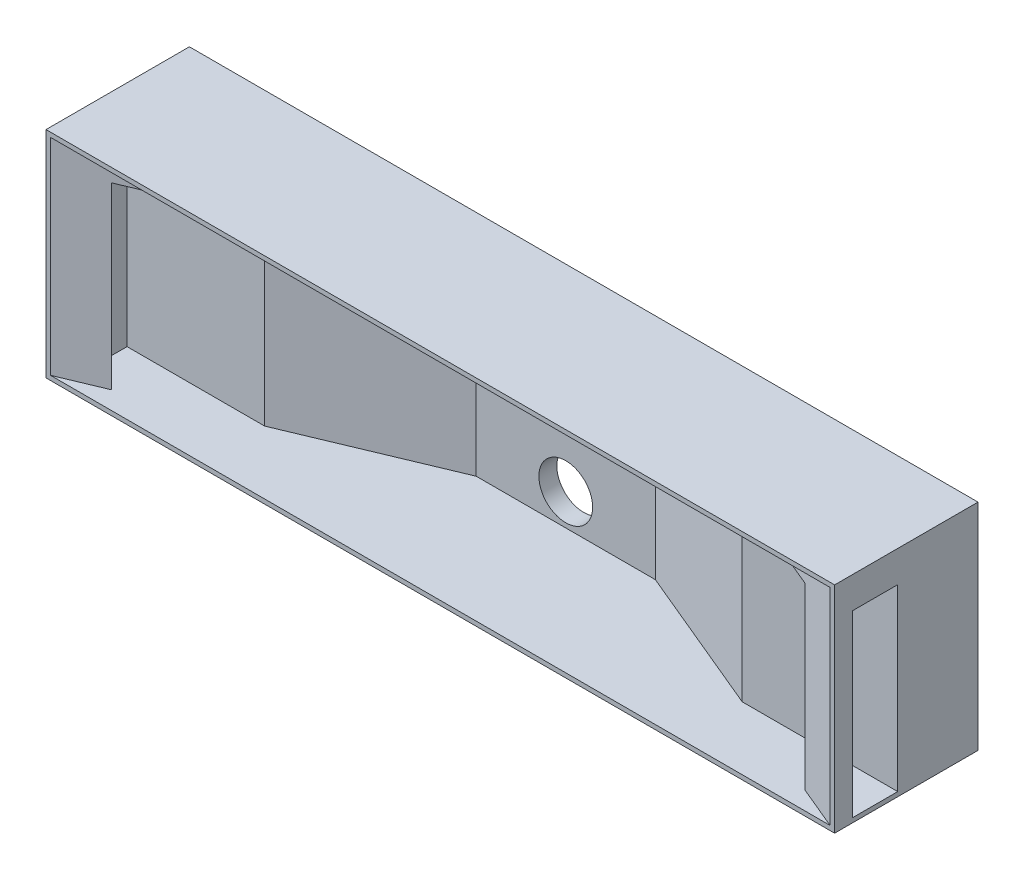
ISO-10303-21;
HEADER;
FILE_DESCRIPTION(('STEP AP214'),'2;1');
FILE_NAME('part.step','',(''),(''),'','','');
FILE_SCHEMA(('AUTOMOTIVE_DESIGN { 1 0 10303 214 1 1 1 1 }'));
ENDSEC;
DATA;
#1=APPLICATION_CONTEXT('core data for automotive mechanical design processes');
#2=APPLICATION_PROTOCOL_DEFINITION('international standard','automotive_design',2000,#1);
#3=PRODUCT_CONTEXT('',#1,'mechanical');
#4=PRODUCT('Part','Part','',(#3));
#5=PRODUCT_RELATED_PRODUCT_CATEGORY('part','',(#4));
#6=PRODUCT_DEFINITION_FORMATION('','',#4);
#7=PRODUCT_DEFINITION_CONTEXT('part definition',#1,'design');
#8=PRODUCT_DEFINITION('design','',#6,#7);
#9=PRODUCT_DEFINITION_SHAPE('','',#8);
#10=(LENGTH_UNIT() NAMED_UNIT(*) SI_UNIT(.MILLI.,.METRE.));
#11=(NAMED_UNIT(*) PLANE_ANGLE_UNIT() SI_UNIT($,.RADIAN.));
#12=(NAMED_UNIT(*) SI_UNIT($,.STERADIAN.) SOLID_ANGLE_UNIT());
#13=UNCERTAINTY_MEASURE_WITH_UNIT(LENGTH_MEASURE(1.E-05),#10,'distance_accuracy_value','');
#14=(GEOMETRIC_REPRESENTATION_CONTEXT(3) GLOBAL_UNCERTAINTY_ASSIGNED_CONTEXT((#13)) GLOBAL_UNIT_ASSIGNED_CONTEXT((#10,
#11,#12)) REPRESENTATION_CONTEXT('',''));
#15=CARTESIAN_POINT('',(0.,0.,0.));
#16=DIRECTION('',(0.,0.,1.));
#17=DIRECTION('',(1.,0.,0.));
#18=AXIS2_PLACEMENT_3D('',#15,#16,#17);
#19=CARTESIAN_POINT('',(3.175,3.175,101.6));
#20=DIRECTION('',(0.,1.,0.));
#21=DIRECTION('',(-1.,0.,0.));
#22=AXIS2_PLACEMENT_3D('',#19,#20,#21);
#23=PLANE('',#22);
#24=DIRECTION('',(0.922668973832998,0.,-0.38559300398991));
#25=VECTOR('',#24,1.);
#26=CARTESIAN_POINT('',(3.175,3.175,101.6));
#27=LINE('',#26,#25);
#28=CARTESIAN_POINT('',(110.220000846774,3.17500000000001,56.8647757655274));
#29=VERTEX_POINT('',#28);
#30=CARTESIAN_POINT('',(215.9,3.175,12.6999999999999));
#31=VERTEX_POINT('',#30);
#32=EDGE_CURVE('E229',#29,#31,#27,.T.);
#33=ORIENTED_EDGE('',*,*,#32,.F.);
#34=DIRECTION('',(1.,0.,0.));
#35=VECTOR('',#34,1.);
#36=CARTESIAN_POINT('',(12.6999999999999,3.175,56.8647757655274));
#37=LINE('',#36,#35);
#38=CARTESIAN_POINT('',(12.6999999999999,3.175,56.8647757655274));
#39=VERTEX_POINT('',#38);
#40=EDGE_CURVE('E166',#39,#29,#37,.T.);
#41=ORIENTED_EDGE('',*,*,#40,.F.);
#42=DIRECTION('',(0.,0.,-1.));
#43=VECTOR('',#42,1.);
#44=CARTESIAN_POINT('',(12.6999999999999,3.175,88.9));
#45=LINE('',#44,#43);
#46=CARTESIAN_POINT('',(12.6999999999999,3.175,88.9));
#47=VERTEX_POINT('',#46);
#48=EDGE_CURVE('E164',#47,#39,#45,.T.);
#49=ORIENTED_EDGE('',*,*,#48,.F.);
#50=DIRECTION('',(1.,0.,0.));
#51=VECTOR('',#50,1.);
#52=CARTESIAN_POINT('',(12.6999999999999,3.175,88.9));
#53=LINE('',#52,#51);
#54=CARTESIAN_POINT('',(33.5642857142857,3.175,88.9));
#55=VERTEX_POINT('',#54);
#56=EDGE_CURVE('E62',#47,#55,#53,.T.);
#57=ORIENTED_EDGE('',*,*,#56,.T.);
#58=CARTESIAN_POINT('',(3.175,3.175,101.6));
#59=VERTEX_POINT('',#58);
#60=EDGE_CURVE('E226',#59,#55,#27,.T.);
#61=ORIENTED_EDGE('',*,*,#60,.F.);
#62=DIRECTION('',(1.,0.,0.));
#63=VECTOR('',#62,1.);
#64=CARTESIAN_POINT('',(3.175,3.175,101.6));
#65=LINE('',#64,#63);
#66=CARTESIAN_POINT('',(555.625,3.175,101.6));
#67=VERTEX_POINT('',#66);
#68=EDGE_CURVE('E233',#59,#67,#65,.T.);
#69=ORIENTED_EDGE('',*,*,#68,.T.);
#70=DIRECTION('',(0.922668973832998,0.,0.38559300398991));
#71=VECTOR('',#70,1.);
#72=CARTESIAN_POINT('',(342.9,3.175,12.7));
#73=LINE('',#72,#71);
#74=CARTESIAN_POINT('',(525.235714285714,3.17500000000001,88.9));
#75=VERTEX_POINT('',#74);
#76=EDGE_CURVE('E213',#75,#67,#73,.T.);
#77=ORIENTED_EDGE('',*,*,#76,.F.);
#78=CARTESIAN_POINT('',(558.8,3.175,88.9));
#79=VERTEX_POINT('',#78);
#80=EDGE_CURVE('E161',#75,#79,#53,.T.);
#81=ORIENTED_EDGE('',*,*,#80,.T.);
#82=DIRECTION('',(0.,0.,-1.));
#83=VECTOR('',#82,1.);
#84=CARTESIAN_POINT('',(558.8,3.175,88.9));
#85=LINE('',#84,#83);
#86=CARTESIAN_POINT('',(558.8,3.175,56.8647757655274));
#87=VERTEX_POINT('',#86);
#88=EDGE_CURVE('E184',#79,#87,#85,.T.);
#89=ORIENTED_EDGE('',*,*,#88,.T.);
#90=CARTESIAN_POINT('',(448.579999153226,3.175,56.8647757655274));
#91=VERTEX_POINT('',#90);
#92=EDGE_CURVE('E160',#91,#87,#37,.T.);
#93=ORIENTED_EDGE('',*,*,#92,.F.);
#94=CARTESIAN_POINT('',(342.9,3.175,12.7));
#95=VERTEX_POINT('',#94);
#96=EDGE_CURVE('E218',#95,#91,#73,.T.);
#97=ORIENTED_EDGE('',*,*,#96,.F.);
#98=DIRECTION('',(-1.,0.,0.));
#99=VECTOR('',#98,1.);
#100=CARTESIAN_POINT('',(0.,3.175,12.7));
#101=LINE('',#100,#99);
#102=EDGE_CURVE('E208',#95,#31,#101,.T.);
#103=ORIENTED_EDGE('',*,*,#102,.T.);
#104=EDGE_LOOP('',(#33,#41,#49,#57,#61,#69,#77,#81,#89,#93,#97,#103));
#105=FACE_BOUND('',#104,.T.);
#106=ADVANCED_FACE('F39',(#105),#23,.T.);
#107=CARTESIAN_POINT('',(3.175,149.225,101.6));
#108=DIRECTION('',(0.,-1.,0.));
#109=DIRECTION('',(0.,0.,-1.));
#110=AXIS2_PLACEMENT_3D('',#107,#108,#109);
#111=PLANE('',#110);
#112=DIRECTION('',(-0.922668973832998,0.,0.38559300398991));
#113=VECTOR('',#112,1.);
#114=CARTESIAN_POINT('',(3.175,149.225,101.6));
#115=LINE('',#114,#113);
#116=CARTESIAN_POINT('',(215.9,149.225,12.6999999999999));
#117=VERTEX_POINT('',#116);
#118=CARTESIAN_POINT('',(3.175,149.225,101.6));
#119=VERTEX_POINT('',#118);
#120=EDGE_CURVE('E223',#117,#119,#115,.T.);
#121=ORIENTED_EDGE('',*,*,#120,.F.);
#122=DIRECTION('',(-1.,0.,0.));
#123=VECTOR('',#122,1.);
#124=CARTESIAN_POINT('',(0.,149.225,12.7));
#125=LINE('',#124,#123);
#126=CARTESIAN_POINT('',(342.9,149.225,12.6999999999999));
#127=VERTEX_POINT('',#126);
#128=EDGE_CURVE('E211',#127,#117,#125,.T.);
#129=ORIENTED_EDGE('',*,*,#128,.F.);
#130=DIRECTION('',(-0.922668973832998,0.,-0.38559300398991));
#131=VECTOR('',#130,1.);
#132=CARTESIAN_POINT('',(342.9,149.225,12.7));
#133=LINE('',#132,#131);
#134=CARTESIAN_POINT('',(555.625,149.225,101.6));
#135=VERTEX_POINT('',#134);
#136=EDGE_CURVE('E217',#135,#127,#133,.T.);
#137=ORIENTED_EDGE('',*,*,#136,.F.);
#138=DIRECTION('',(-1.,0.,0.));
#139=VECTOR('',#138,1.);
#140=CARTESIAN_POINT('',(3.175,149.225,101.6));
#141=LINE('',#140,#139);
#142=EDGE_CURVE('E239',#135,#119,#141,.T.);
#143=ORIENTED_EDGE('',*,*,#142,.T.);
#144=EDGE_LOOP('',(#121,#129,#137,#143));
#145=FACE_BOUND('',#144,.T.);
#146=ADVANCED_FACE('F306',(#145),#111,.T.);
#147=CARTESIAN_POINT('',(0.,0.,101.6));
#148=DIRECTION('',(0.,0.,-1.));
#149=DIRECTION('',(-1.,0.,0.));
#150=AXIS2_PLACEMENT_3D('',#147,#148,#149);
#151=PLANE('',#150);
#152=DIRECTION('',(0.,-1.,0.));
#153=VECTOR('',#152,1.);
#154=CARTESIAN_POINT('',(0.,0.,101.6));
#155=LINE('',#154,#153);
#156=CARTESIAN_POINT('',(0.,152.4,101.6));
#157=VERTEX_POINT('',#156);
#158=CARTESIAN_POINT('',(0.,0.,101.6));
#159=VERTEX_POINT('',#158);
#160=EDGE_CURVE('E243',#157,#159,#155,.T.);
#161=ORIENTED_EDGE('',*,*,#160,.T.);
#162=DIRECTION('',(1.,0.,0.));
#163=VECTOR('',#162,1.);
#164=CARTESIAN_POINT('',(0.,0.,101.6));
#165=LINE('',#164,#163);
#166=CARTESIAN_POINT('',(558.8,0.,101.6));
#167=VERTEX_POINT('',#166);
#168=EDGE_CURVE('E246',#159,#167,#165,.T.);
#169=ORIENTED_EDGE('',*,*,#168,.T.);
#170=DIRECTION('',(0.,1.,0.));
#171=VECTOR('',#170,1.);
#172=CARTESIAN_POINT('',(558.8,0.,101.6));
#173=LINE('',#172,#171);
#174=CARTESIAN_POINT('',(558.8,152.4,101.6));
#175=VERTEX_POINT('',#174);
#176=EDGE_CURVE('E249',#167,#175,#173,.T.);
#177=ORIENTED_EDGE('',*,*,#176,.T.);
#178=DIRECTION('',(-1.,0.,0.));
#179=VECTOR('',#178,1.);
#180=CARTESIAN_POINT('',(0.,152.4,101.6));
#181=LINE('',#180,#179);
#182=EDGE_CURVE('E251',#175,#157,#181,.T.);
#183=ORIENTED_EDGE('',*,*,#182,.T.);
#184=EDGE_LOOP('',(#161,#169,#177,#183));
#185=FACE_BOUND('',#184,.T.);
#186=DIRECTION('',(0.,-1.,0.));
#187=VECTOR('',#186,1.);
#188=CARTESIAN_POINT('',(3.175,3.175,101.6));
#189=LINE('',#188,#187);
#190=EDGE_CURVE('E228',#119,#59,#189,.T.);
#191=ORIENTED_EDGE('',*,*,#190,.F.);
#192=ORIENTED_EDGE('',*,*,#142,.F.);
#193=DIRECTION('',(0.,1.,0.));
#194=VECTOR('',#193,1.);
#195=CARTESIAN_POINT('',(555.625,3.175,101.6));
#196=LINE('',#195,#194);
#197=EDGE_CURVE('E236',#67,#135,#196,.T.);
#198=ORIENTED_EDGE('',*,*,#197,.F.);
#199=ORIENTED_EDGE('',*,*,#68,.F.);
#200=EDGE_LOOP('',(#191,#192,#198,#199));
#201=FACE_BOUND('',#200,.T.);
#202=ADVANCED_FACE('F311',(#185,#201),#151,.F.);
#203=CARTESIAN_POINT('',(0.,0.,0.));
#204=DIRECTION('',(0.,0.,-1.));
#205=DIRECTION('',(-1.,0.,0.));
#206=AXIS2_PLACEMENT_3D('',#203,#204,#205);
#207=PLANE('',#206);
#208=CARTESIAN_POINT('',(279.4,25.4,0.));
#209=DIRECTION('',(0.,0.,-1.));
#210=DIRECTION('',(-1.,0.,0.));
#211=AXIS2_PLACEMENT_3D('',#208,#209,#210);
#212=CIRCLE('',#211,19.05);
#213=CARTESIAN_POINT('',(260.35,25.4,0.));
#214=VERTEX_POINT('',#213);
#215=EDGE_CURVE('E204',#214,#214,#212,.T.);
#216=ORIENTED_EDGE('',*,*,#215,.F.);
#217=EDGE_LOOP('',(#216));
#218=FACE_BOUND('',#217,.T.);
#219=DIRECTION('',(0.,-1.,0.));
#220=VECTOR('',#219,1.);
#221=CARTESIAN_POINT('',(0.,0.,0.));
#222=LINE('',#221,#220);
#223=CARTESIAN_POINT('',(0.,152.4,0.));
#224=VERTEX_POINT('',#223);
#225=CARTESIAN_POINT('',(0.,0.,0.));
#226=VERTEX_POINT('',#225);
#227=EDGE_CURVE('E242',#224,#226,#222,.T.);
#228=ORIENTED_EDGE('',*,*,#227,.F.);
#229=DIRECTION('',(-1.,0.,0.));
#230=VECTOR('',#229,1.);
#231=CARTESIAN_POINT('',(0.,152.4,0.));
#232=LINE('',#231,#230);
#233=CARTESIAN_POINT('',(558.8,152.4,0.));
#234=VERTEX_POINT('',#233);
#235=EDGE_CURVE('E247',#234,#224,#232,.T.);
#236=ORIENTED_EDGE('',*,*,#235,.F.);
#237=DIRECTION('',(0.,1.,0.));
#238=VECTOR('',#237,1.);
#239=CARTESIAN_POINT('',(558.8,0.,0.));
#240=LINE('',#239,#238);
#241=CARTESIAN_POINT('',(558.8,0.,0.));
#242=VERTEX_POINT('',#241);
#243=EDGE_CURVE('E258',#242,#234,#240,.T.);
#244=ORIENTED_EDGE('',*,*,#243,.F.);
#245=DIRECTION('',(1.,0.,0.));
#246=VECTOR('',#245,1.);
#247=CARTESIAN_POINT('',(0.,0.,0.));
#248=LINE('',#247,#246);
#249=EDGE_CURVE('E256',#226,#242,#248,.T.);
#250=ORIENTED_EDGE('',*,*,#249,.F.);
#251=EDGE_LOOP('',(#228,#236,#244,#250));
#252=FACE_BOUND('',#251,.T.);
#253=ADVANCED_FACE('F318',(#218,#252),#207,.T.);
#254=CARTESIAN_POINT('',(0.,0.,101.6));
#255=DIRECTION('',(1.,0.,0.));
#256=DIRECTION('',(0.,0.,-1.));
#257=AXIS2_PLACEMENT_3D('',#254,#255,#256);
#258=PLANE('',#257);
#259=ORIENTED_EDGE('',*,*,#227,.T.);
#260=DIRECTION('',(0.,0.,-1.));
#261=VECTOR('',#260,1.);
#262=CARTESIAN_POINT('',(0.,0.,101.6));
#263=LINE('',#262,#261);
#264=EDGE_CURVE('E269',#159,#226,#263,.T.);
#265=ORIENTED_EDGE('',*,*,#264,.F.);
#266=ORIENTED_EDGE('',*,*,#160,.F.);
#267=DIRECTION('',(0.,0.,-1.));
#268=VECTOR('',#267,1.);
#269=CARTESIAN_POINT('',(0.,152.4,101.6));
#270=LINE('',#269,#268);
#271=EDGE_CURVE('E253',#157,#224,#270,.T.);
#272=ORIENTED_EDGE('',*,*,#271,.T.);
#273=EDGE_LOOP('',(#259,#265,#266,#272));
#274=FACE_BOUND('',#273,.T.);
#275=ADVANCED_FACE('F41',(#274),#258,.F.);
#276=CARTESIAN_POINT('',(0.,0.,101.6));
#277=DIRECTION('',(0.,1.,0.));
#278=DIRECTION('',(0.,0.,1.));
#279=AXIS2_PLACEMENT_3D('',#276,#277,#278);
#280=PLANE('',#279);
#281=ORIENTED_EDGE('',*,*,#249,.T.);
#282=DIRECTION('',(0.,0.,-1.));
#283=VECTOR('',#282,1.);
#284=CARTESIAN_POINT('',(558.8,0.,101.6));
#285=LINE('',#284,#283);
#286=EDGE_CURVE('E266',#167,#242,#285,.T.);
#287=ORIENTED_EDGE('',*,*,#286,.F.);
#288=ORIENTED_EDGE('',*,*,#168,.F.);
#289=ORIENTED_EDGE('',*,*,#264,.T.);
#290=EDGE_LOOP('',(#281,#287,#288,#289));
#291=FACE_BOUND('',#290,.T.);
#292=ADVANCED_FACE('F329',(#291),#280,.F.);
#293=CARTESIAN_POINT('',(558.8,0.,101.6));
#294=DIRECTION('',(-1.,0.,0.));
#295=DIRECTION('',(0.,0.,1.));
#296=AXIS2_PLACEMENT_3D('',#293,#294,#295);
#297=PLANE('',#296);
#298=ORIENTED_EDGE('',*,*,#88,.F.);
#299=DIRECTION('',(0.,-1.,0.));
#300=VECTOR('',#299,1.);
#301=CARTESIAN_POINT('',(558.8,130.175,88.9));
#302=LINE('',#301,#300);
#303=CARTESIAN_POINT('',(558.8,130.175,88.9));
#304=VERTEX_POINT('',#303);
#305=EDGE_CURVE('E54',#304,#79,#302,.T.);
#306=ORIENTED_EDGE('',*,*,#305,.F.);
#307=DIRECTION('',(0.,0.,1.));
#308=VECTOR('',#307,1.);
#309=CARTESIAN_POINT('',(558.8,130.175,88.9));
#310=LINE('',#309,#308);
#311=CARTESIAN_POINT('',(558.8,130.175,56.8647757655274));
#312=VERTEX_POINT('',#311);
#313=EDGE_CURVE('E175',#312,#304,#310,.T.);
#314=ORIENTED_EDGE('',*,*,#313,.F.);
#315=DIRECTION('',(0.,1.,0.));
#316=VECTOR('',#315,1.);
#317=CARTESIAN_POINT('',(558.8,130.175,56.8647757655274));
#318=LINE('',#317,#316);
#319=EDGE_CURVE('E178',#87,#312,#318,.T.);
#320=ORIENTED_EDGE('',*,*,#319,.F.);
#321=EDGE_LOOP('',(#298,#306,#314,#320));
#322=FACE_BOUND('',#321,.T.);
#323=ORIENTED_EDGE('',*,*,#243,.T.);
#324=DIRECTION('',(0.,0.,-1.));
#325=VECTOR('',#324,1.);
#326=CARTESIAN_POINT('',(558.8,152.4,101.6));
#327=LINE('',#326,#325);
#328=EDGE_CURVE('E263',#175,#234,#327,.T.);
#329=ORIENTED_EDGE('',*,*,#328,.F.);
#330=ORIENTED_EDGE('',*,*,#176,.F.);
#331=ORIENTED_EDGE('',*,*,#286,.T.);
#332=EDGE_LOOP('',(#323,#329,#330,#331));
#333=FACE_BOUND('',#332,.T.);
#334=ADVANCED_FACE('F291',(#322,#333),#297,.F.);
#335=CARTESIAN_POINT('',(0.,152.4,101.6));
#336=DIRECTION('',(0.,-1.,0.));
#337=DIRECTION('',(0.,0.,-1.));
#338=AXIS2_PLACEMENT_3D('',#335,#336,#337);
#339=PLANE('',#338);
#340=ORIENTED_EDGE('',*,*,#235,.T.);
#341=ORIENTED_EDGE('',*,*,#271,.F.);
#342=ORIENTED_EDGE('',*,*,#182,.F.);
#343=ORIENTED_EDGE('',*,*,#328,.T.);
#344=EDGE_LOOP('',(#340,#341,#342,#343));
#345=FACE_BOUND('',#344,.T.);
#346=ADVANCED_FACE('F323',(#345),#339,.F.);
#347=CARTESIAN_POINT('',(3.175,152.402,101.6));
#348=DIRECTION('',(-0.38559300398991,0.,-0.922668973832998));
#349=DIRECTION('',(-0.922668973832998,0.,0.38559300398991));
#350=AXIS2_PLACEMENT_3D('',#347,#348,#349);
#351=PLANE('',#350);
#352=ORIENTED_EDGE('',*,*,#60,.T.);
#353=DIRECTION('',(0.,1.,0.));
#354=VECTOR('',#353,1.);
#355=CARTESIAN_POINT('',(33.5642857142857,152.402,88.9));
#356=LINE('',#355,#354);
#357=CARTESIAN_POINT('',(33.5642857142857,130.175,88.9));
#358=VERTEX_POINT('',#357);
#359=EDGE_CURVE('E158',#55,#358,#356,.T.);
#360=ORIENTED_EDGE('',*,*,#359,.T.);
#361=DIRECTION('',(0.922668973832998,0.,-0.38559300398991));
#362=VECTOR('',#361,1.);
#363=CARTESIAN_POINT('',(3.175,130.175,101.6));
#364=LINE('',#363,#362);
#365=CARTESIAN_POINT('',(110.220000846774,130.175,56.8647757655274));
#366=VERTEX_POINT('',#365);
#367=EDGE_CURVE('E200',#358,#366,#364,.T.);
#368=ORIENTED_EDGE('',*,*,#367,.T.);
#369=DIRECTION('',(0.,-1.,0.));
#370=VECTOR('',#369,1.);
#371=CARTESIAN_POINT('',(110.220000846774,152.402,56.8647757655274));
#372=LINE('',#371,#370);
#373=EDGE_CURVE('E191',#366,#29,#372,.T.);
#374=ORIENTED_EDGE('',*,*,#373,.T.);
#375=ORIENTED_EDGE('',*,*,#32,.T.);
#376=DIRECTION('',(0.,-1.,0.));
#377=VECTOR('',#376,1.);
#378=CARTESIAN_POINT('',(215.9,152.402,12.7));
#379=LINE('',#378,#377);
#380=EDGE_CURVE('E225',#117,#31,#379,.T.);
#381=ORIENTED_EDGE('',*,*,#380,.F.);
#382=ORIENTED_EDGE('',*,*,#120,.T.);
#383=ORIENTED_EDGE('',*,*,#190,.T.);
#384=EDGE_LOOP('',(#352,#360,#368,#374,#375,#381,#382,#383));
#385=FACE_BOUND('',#384,.T.);
#386=ADVANCED_FACE('F326',(#385),#351,.F.);
#387=CARTESIAN_POINT('',(342.9,152.402,12.7));
#388=DIRECTION('',(0.38559300398991,0.,-0.922668973832998));
#389=DIRECTION('',(-0.922668973832998,0.,-0.38559300398991));
#390=AXIS2_PLACEMENT_3D('',#387,#388,#389);
#391=PLANE('',#390);
#392=DIRECTION('',(0.922668973832998,0.,0.38559300398991));
#393=VECTOR('',#392,1.);
#394=CARTESIAN_POINT('',(342.9,130.175,12.7));
#395=LINE('',#394,#393);
#396=CARTESIAN_POINT('',(448.579999153226,130.175,56.8647757655274));
#397=VERTEX_POINT('',#396);
#398=CARTESIAN_POINT('',(525.235714285714,130.175,88.9000000000001));
#399=VERTEX_POINT('',#398);
#400=EDGE_CURVE('E47',#397,#399,#395,.T.);
#401=ORIENTED_EDGE('',*,*,#400,.T.);
#402=DIRECTION('',(0.,-1.,0.));
#403=VECTOR('',#402,1.);
#404=CARTESIAN_POINT('',(525.235714285714,152.402,88.9));
#405=LINE('',#404,#403);
#406=EDGE_CURVE('E11',#399,#75,#405,.T.);
#407=ORIENTED_EDGE('',*,*,#406,.T.);
#408=ORIENTED_EDGE('',*,*,#76,.T.);
#409=ORIENTED_EDGE('',*,*,#197,.T.);
#410=ORIENTED_EDGE('',*,*,#136,.T.);
#411=DIRECTION('',(0.,-1.,0.));
#412=VECTOR('',#411,1.);
#413=CARTESIAN_POINT('',(342.9,152.402,12.7));
#414=LINE('',#413,#412);
#415=EDGE_CURVE('E214',#127,#95,#414,.T.);
#416=ORIENTED_EDGE('',*,*,#415,.T.);
#417=ORIENTED_EDGE('',*,*,#96,.T.);
#418=DIRECTION('',(0.,1.,0.));
#419=VECTOR('',#418,1.);
#420=CARTESIAN_POINT('',(448.579999153226,152.402,56.8647757655274));
#421=LINE('',#420,#419);
#422=EDGE_CURVE('E272',#91,#397,#421,.T.);
#423=ORIENTED_EDGE('',*,*,#422,.T.);
#424=EDGE_LOOP('',(#401,#407,#408,#409,#410,#416,#417,#423));
#425=FACE_BOUND('',#424,.T.);
#426=ADVANCED_FACE('F278',(#425),#391,.F.);
#427=CARTESIAN_POINT('',(0.,0.,12.7));
#428=DIRECTION('',(0.,0.,-1.));
#429=DIRECTION('',(-1.,0.,0.));
#430=AXIS2_PLACEMENT_3D('',#427,#428,#429);
#431=PLANE('',#430);
#432=CARTESIAN_POINT('',(279.4,25.4,12.6999999999999));
#433=DIRECTION('',(0.,0.,-1.));
#434=DIRECTION('',(-1.,0.,0.));
#435=AXIS2_PLACEMENT_3D('',#432,#433,#434);
#436=CIRCLE('',#435,19.05);
#437=CARTESIAN_POINT('',(260.35,25.4,12.6999999999999));
#438=VERTEX_POINT('',#437);
#439=EDGE_CURVE('E207',#438,#438,#436,.T.);
#440=ORIENTED_EDGE('',*,*,#439,.T.);
#441=EDGE_LOOP('',(#440));
#442=FACE_BOUND('',#441,.T.);
#443=ORIENTED_EDGE('',*,*,#128,.T.);
#444=ORIENTED_EDGE('',*,*,#380,.T.);
#445=ORIENTED_EDGE('',*,*,#102,.F.);
#446=ORIENTED_EDGE('',*,*,#415,.F.);
#447=EDGE_LOOP('',(#443,#444,#445,#446));
#448=FACE_BOUND('',#447,.T.);
#449=ADVANCED_FACE('F357',(#442,#448),#431,.F.);
#450=CARTESIAN_POINT('',(279.4,25.4,101.6));
#451=DIRECTION('',(0.,0.,-1.));
#452=DIRECTION('',(-1.,0.,0.));
#453=AXIS2_PLACEMENT_3D('',#450,#451,#452);
#454=CYLINDRICAL_SURFACE('',#453,19.05);
#455=ORIENTED_EDGE('',*,*,#215,.T.);
#456=EDGE_LOOP('',(#455));
#457=FACE_BOUND('',#456,.T.);
#458=ORIENTED_EDGE('',*,*,#439,.F.);
#459=EDGE_LOOP('',(#458));
#460=FACE_BOUND('',#459,.T.);
#461=ADVANCED_FACE('F407',(#457,#460),#454,.F.);
#462=CARTESIAN_POINT('',(12.6999999999999,130.175,56.8647757655274));
#463=DIRECTION('',(0.,0.,-1.));
#464=DIRECTION('',(0.,1.,0.));
#465=AXIS2_PLACEMENT_3D('',#462,#463,#464);
#466=PLANE('',#465);
#467=ORIENTED_EDGE('',*,*,#92,.T.);
#468=ORIENTED_EDGE('',*,*,#319,.T.);
#469=DIRECTION('',(1.,0.,0.));
#470=VECTOR('',#469,1.);
#471=CARTESIAN_POINT('',(12.6999999999999,130.175,56.8647757655274));
#472=LINE('',#471,#470);
#473=EDGE_CURVE('E196',#397,#312,#472,.T.);
#474=ORIENTED_EDGE('',*,*,#473,.F.);
#475=ORIENTED_EDGE('',*,*,#422,.F.);
#476=EDGE_LOOP('',(#467,#468,#474,#475));
#477=FACE_BOUND('',#476,.T.);
#478=ADVANCED_FACE('F286',(#477),#466,.F.);
#479=CARTESIAN_POINT('',(12.6999999999999,130.175,88.9));
#480=DIRECTION('',(0.,1.,0.));
#481=DIRECTION('',(0.,0.,1.));
#482=AXIS2_PLACEMENT_3D('',#479,#480,#481);
#483=PLANE('',#482);
#484=ORIENTED_EDGE('',*,*,#473,.T.);
#485=ORIENTED_EDGE('',*,*,#313,.T.);
#486=DIRECTION('',(1.,0.,0.));
#487=VECTOR('',#486,1.);
#488=CARTESIAN_POINT('',(12.6999999999999,130.175,88.9));
#489=LINE('',#488,#487);
#490=EDGE_CURVE('E192',#399,#304,#489,.T.);
#491=ORIENTED_EDGE('',*,*,#490,.F.);
#492=ORIENTED_EDGE('',*,*,#400,.F.);
#493=EDGE_LOOP('',(#484,#485,#491,#492));
#494=FACE_BOUND('',#493,.T.);
#495=ADVANCED_FACE('F284',(#494),#483,.F.);
#496=CARTESIAN_POINT('',(12.6999999999999,130.175,88.9));
#497=DIRECTION('',(0.,0.,1.));
#498=DIRECTION('',(0.,-1.,0.));
#499=AXIS2_PLACEMENT_3D('',#496,#497,#498);
#500=PLANE('',#499);
#501=ORIENTED_EDGE('',*,*,#490,.T.);
#502=ORIENTED_EDGE('',*,*,#305,.T.);
#503=ORIENTED_EDGE('',*,*,#80,.F.);
#504=ORIENTED_EDGE('',*,*,#406,.F.);
#505=EDGE_LOOP('',(#501,#502,#503,#504));
#506=FACE_BOUND('',#505,.T.);
#507=ADVANCED_FACE('F294',(#506),#500,.F.);
#508=ORIENTED_EDGE('',*,*,#56,.F.);
#509=DIRECTION('',(0.,-1.,0.));
#510=VECTOR('',#509,1.);
#511=CARTESIAN_POINT('',(12.6999999999999,130.175,88.9));
#512=LINE('',#511,#510);
#513=CARTESIAN_POINT('',(12.6999999999999,130.175,88.9));
#514=VERTEX_POINT('',#513);
#515=EDGE_CURVE('E155',#514,#47,#512,.T.);
#516=ORIENTED_EDGE('',*,*,#515,.F.);
#517=EDGE_CURVE('E189',#514,#358,#489,.T.);
#518=ORIENTED_EDGE('',*,*,#517,.T.);
#519=ORIENTED_EDGE('',*,*,#359,.F.);
#520=EDGE_LOOP('',(#508,#516,#518,#519));
#521=FACE_BOUND('',#520,.T.);
#522=ADVANCED_FACE('F152',(#521),#500,.F.);
#523=ORIENTED_EDGE('',*,*,#517,.F.);
#524=DIRECTION('',(0.,0.,1.));
#525=VECTOR('',#524,1.);
#526=CARTESIAN_POINT('',(12.6999999999999,130.175,88.9));
#527=LINE('',#526,#525);
#528=CARTESIAN_POINT('',(12.6999999999999,130.175,56.8647757655274));
#529=VERTEX_POINT('',#528);
#530=EDGE_CURVE('E174',#529,#514,#527,.T.);
#531=ORIENTED_EDGE('',*,*,#530,.F.);
#532=EDGE_CURVE('E193',#529,#366,#472,.T.);
#533=ORIENTED_EDGE('',*,*,#532,.T.);
#534=ORIENTED_EDGE('',*,*,#367,.F.);
#535=EDGE_LOOP('',(#523,#531,#533,#534));
#536=FACE_BOUND('',#535,.T.);
#537=ADVANCED_FACE('F301',(#536),#483,.F.);
#538=ORIENTED_EDGE('',*,*,#532,.F.);
#539=DIRECTION('',(0.,1.,0.));
#540=VECTOR('',#539,1.);
#541=CARTESIAN_POINT('',(12.6999999999999,130.175,56.8647757655274));
#542=LINE('',#541,#540);
#543=EDGE_CURVE('E170',#39,#529,#542,.T.);
#544=ORIENTED_EDGE('',*,*,#543,.F.);
#545=ORIENTED_EDGE('',*,*,#40,.T.);
#546=ORIENTED_EDGE('',*,*,#373,.F.);
#547=EDGE_LOOP('',(#538,#544,#545,#546));
#548=FACE_BOUND('',#547,.T.);
#549=ADVANCED_FACE('F359',(#548),#466,.F.);
#550=CARTESIAN_POINT('',(12.6999999999999,0.,0.));
#551=DIRECTION('',(1.,0.,0.));
#552=DIRECTION('',(0.,0.,-1.));
#553=AXIS2_PLACEMENT_3D('',#550,#551,#552);
#554=PLANE('',#553);
#555=ORIENTED_EDGE('',*,*,#515,.T.);
#556=ORIENTED_EDGE('',*,*,#48,.T.);
#557=ORIENTED_EDGE('',*,*,#543,.T.);
#558=ORIENTED_EDGE('',*,*,#530,.T.);
#559=EDGE_LOOP('',(#555,#556,#557,#558));
#560=FACE_BOUND('',#559,.T.);
#561=ADVANCED_FACE('F172',(#560),#554,.T.);
#562=CLOSED_SHELL('',(#106,#146,#202,#253,#275,#292,#334,#346,#386,#426,#449,#461,#478,#495,
#507,#522,#537,#549,#561));
#563=MANIFOLD_SOLID_BREP('B2',#562);
#564=ADVANCED_BREP_SHAPE_REPRESENTATION('',(#18,#563),#14);
#565=SHAPE_DEFINITION_REPRESENTATION(#9,#564);
ENDSEC;
END-ISO-10303-21;
